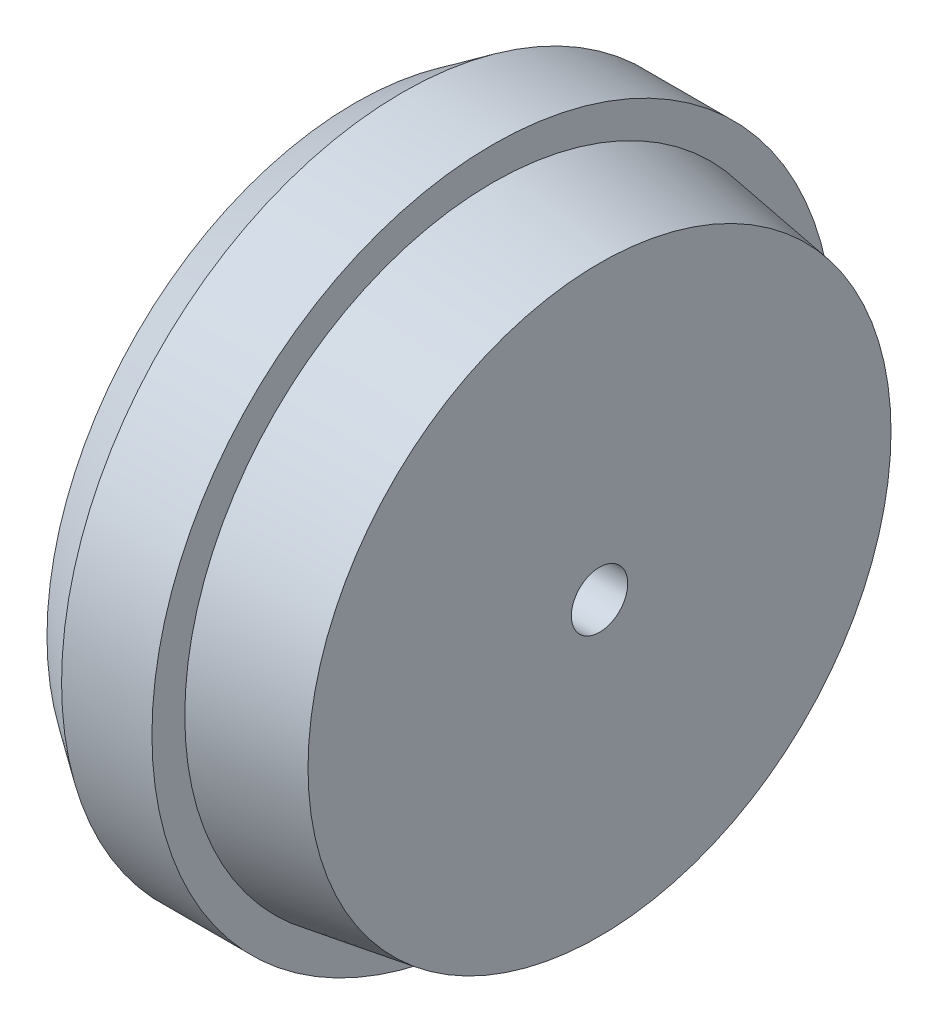
ISO-10303-21;
HEADER;
FILE_DESCRIPTION(('STEP AP214'),'2;1');
FILE_NAME('part.step','',(''),(''),'','','');
FILE_SCHEMA(('AUTOMOTIVE_DESIGN { 1 0 10303 214 1 1 1 1 }'));
ENDSEC;
DATA;
#1=APPLICATION_CONTEXT('core data for automotive mechanical design processes');
#2=APPLICATION_PROTOCOL_DEFINITION('international standard','automotive_design',2000,#1);
#3=PRODUCT_CONTEXT('',#1,'mechanical');
#4=PRODUCT('Part','Part','',(#3));
#5=PRODUCT_RELATED_PRODUCT_CATEGORY('part','',(#4));
#6=PRODUCT_DEFINITION_FORMATION('','',#4);
#7=PRODUCT_DEFINITION_CONTEXT('part definition',#1,'design');
#8=PRODUCT_DEFINITION('design','',#6,#7);
#9=PRODUCT_DEFINITION_SHAPE('','',#8);
#10=(LENGTH_UNIT() NAMED_UNIT(*) SI_UNIT(.MILLI.,.METRE.));
#11=(NAMED_UNIT(*) PLANE_ANGLE_UNIT() SI_UNIT($,.RADIAN.));
#12=(NAMED_UNIT(*) SI_UNIT($,.STERADIAN.) SOLID_ANGLE_UNIT());
#13=UNCERTAINTY_MEASURE_WITH_UNIT(LENGTH_MEASURE(1.E-05),#10,'distance_accuracy_value','');
#14=(GEOMETRIC_REPRESENTATION_CONTEXT(3) GLOBAL_UNCERTAINTY_ASSIGNED_CONTEXT((#13)) GLOBAL_UNIT_ASSIGNED_CONTEXT((#10,
#11,#12)) REPRESENTATION_CONTEXT('',''));
#15=CARTESIAN_POINT('',(0.,0.,0.));
#16=DIRECTION('',(0.,0.,1.));
#17=DIRECTION('',(1.,0.,0.));
#18=AXIS2_PLACEMENT_3D('',#15,#16,#17);
#19=CARTESIAN_POINT('',(540.380162340557,182.950659304077,0.));
#20=DIRECTION('',(1.,0.,0.));
#21=DIRECTION('',(0.,0.,-1.));
#22=AXIS2_PLACEMENT_3D('',#19,#20,#21);
#23=PLANE('',#22);
#24=CARTESIAN_POINT('',(540.380162340557,157.5,0.));
#25=DIRECTION('',(-1.,0.,0.));
#26=DIRECTION('',(0.,0.,1.));
#27=AXIS2_PLACEMENT_3D('',#24,#25,#26);
#28=CIRCLE('',#27,28.4506593040767);
#29=CARTESIAN_POINT('',(540.380162340557,157.5,28.4506593040767));
#30=VERTEX_POINT('',#29);
#31=EDGE_CURVE('E57',#30,#30,#28,.T.);
#32=ORIENTED_EDGE('',*,*,#31,.T.);
#33=EDGE_LOOP('',(#32));
#34=FACE_BOUND('',#33,.T.);
#35=CARTESIAN_POINT('',(540.380162340557,157.5,0.));
#36=DIRECTION('',(-1.,0.,0.));
#37=DIRECTION('',(0.,0.,1.));
#38=AXIS2_PLACEMENT_3D('',#35,#36,#37);
#39=CIRCLE('',#38,22.4506593040767);
#40=CARTESIAN_POINT('',(540.380162340557,157.5,22.4506593040767));
#41=VERTEX_POINT('',#40);
#42=EDGE_CURVE('E18',#41,#41,#39,.F.);
#43=ORIENTED_EDGE('',*,*,#42,.T.);
#44=EDGE_LOOP('',(#43));
#45=FACE_BOUND('',#44,.T.);
#46=ADVANCED_FACE('F15',(#34,#45),#23,.F.);
#47=CARTESIAN_POINT('',(540.380162340557,157.5,0.));
#48=DIRECTION('',(-1.,0.,0.));
#49=DIRECTION('',(0.,0.,1.));
#50=AXIS2_PLACEMENT_3D('',#47,#48,#49);
#51=CONICAL_SURFACE('',#50,22.4506593040767,0.617417972664502);
#52=ORIENTED_EDGE('',*,*,#42,.F.);
#53=EDGE_LOOP('',(#52));
#54=FACE_BOUND('',#53,.T.);
#55=CARTESIAN_POINT('',(543.414213140027,157.5,0.));
#56=DIRECTION('',(1.,0.,0.));
#57=DIRECTION('',(0.,0.,-1.));
#58=AXIS2_PLACEMENT_3D('',#55,#56,#57);
#59=CIRCLE('',#58,20.2964281045427);
#60=CARTESIAN_POINT('',(543.414213140027,157.5,-20.2964281045427));
#61=VERTEX_POINT('',#60);
#62=EDGE_CURVE('E30',#61,#61,#59,.T.);
#63=ORIENTED_EDGE('',*,*,#62,.T.);
#64=EDGE_LOOP('',(#63));
#65=FACE_BOUND('',#64,.T.);
#66=ADVANCED_FACE('F66',(#54,#65),#51,.F.);
#67=CARTESIAN_POINT('',(538.225183996548,157.5,0.));
#68=DIRECTION('',(-1.,0.,0.));
#69=DIRECTION('',(0.,0.,1.));
#70=AXIS2_PLACEMENT_3D('',#67,#68,#69);
#71=CONICAL_SURFACE('',#70,30.6984355865019,0.806472288147619);
#72=CARTESIAN_POINT('',(538.225183996548,157.5,0.));
#73=DIRECTION('',(-1.,0.,0.));
#74=DIRECTION('',(0.,0.,1.));
#75=AXIS2_PLACEMENT_3D('',#72,#73,#74);
#76=CIRCLE('',#75,30.6984355865019);
#77=CARTESIAN_POINT('',(538.225183996548,157.5,30.6984355865019));
#78=VERTEX_POINT('',#77);
#79=EDGE_CURVE('E55',#78,#78,#76,.T.);
#80=ORIENTED_EDGE('',*,*,#79,.T.);
#81=EDGE_LOOP('',(#80));
#82=FACE_BOUND('',#81,.T.);
#83=ORIENTED_EDGE('',*,*,#31,.F.);
#84=EDGE_LOOP('',(#83));
#85=FACE_BOUND('',#84,.T.);
#86=ADVANCED_FACE('F69',(#82,#85),#71,.F.);
#87=CARTESIAN_POINT('',(552.414213140027,157.5,0.));
#88=DIRECTION('',(1.,0.,0.));
#89=DIRECTION('',(0.,0.,-1.));
#90=AXIS2_PLACEMENT_3D('',#87,#88,#89);
#91=CYLINDRICAL_SURFACE('',#90,20.2964281045427);
#92=ORIENTED_EDGE('',*,*,#62,.F.);
#93=EDGE_LOOP('',(#92));
#94=FACE_BOUND('',#93,.T.);
#95=CARTESIAN_POINT('',(561.414213140027,157.5,0.));
#96=DIRECTION('',(1.,0.,0.));
#97=DIRECTION('',(0.,0.,-1.));
#98=AXIS2_PLACEMENT_3D('',#95,#96,#97);
#99=CIRCLE('',#98,20.2964281045427);
#100=CARTESIAN_POINT('',(561.414213140027,157.5,-20.2964281045427));
#101=VERTEX_POINT('',#100);
#102=EDGE_CURVE('E52',#101,#101,#99,.T.);
#103=ORIENTED_EDGE('',*,*,#102,.T.);
#104=EDGE_LOOP('',(#103));
#105=FACE_BOUND('',#104,.T.);
#106=ADVANCED_FACE('F72',(#94,#105),#91,.F.);
#107=CARTESIAN_POINT('',(538.225183996548,191.591028649868,0.));
#108=DIRECTION('',(1.,0.,0.));
#109=DIRECTION('',(0.,0.,-1.));
#110=AXIS2_PLACEMENT_3D('',#107,#108,#109);
#111=PLANE('',#110);
#112=CARTESIAN_POINT('',(538.225183996548,157.5,0.));
#113=DIRECTION('',(1.,0.,0.));
#114=DIRECTION('',(0.,0.,-1.));
#115=AXIS2_PLACEMENT_3D('',#112,#113,#114);
#116=CIRCLE('',#115,37.483621713234);
#117=CARTESIAN_POINT('',(538.225183996548,157.5,-37.483621713234));
#118=VERTEX_POINT('',#117);
#119=EDGE_CURVE('E49',#118,#118,#116,.T.);
#120=ORIENTED_EDGE('',*,*,#119,.F.);
#121=EDGE_LOOP('',(#120));
#122=FACE_BOUND('',#121,.T.);
#123=ORIENTED_EDGE('',*,*,#79,.F.);
#124=EDGE_LOOP('',(#123));
#125=FACE_BOUND('',#124,.T.);
#126=ADVANCED_FACE('F75',(#122,#125),#111,.F.);
#127=CARTESIAN_POINT('',(561.414213140027,173.285973635778,0.));
#128=DIRECTION('',(1.,0.,0.));
#129=DIRECTION('',(0.,0.,-1.));
#130=AXIS2_PLACEMENT_3D('',#127,#128,#129);
#131=PLANE('',#130);
#132=ORIENTED_EDGE('',*,*,#102,.F.);
#133=EDGE_LOOP('',(#132));
#134=FACE_BOUND('',#133,.T.);
#135=CARTESIAN_POINT('',(561.414213140027,157.5,0.));
#136=DIRECTION('',(1.,0.,0.));
#137=DIRECTION('',(0.,0.,-1.));
#138=AXIS2_PLACEMENT_3D('',#135,#136,#137);
#139=CIRCLE('',#138,11.2755191670138);
#140=CARTESIAN_POINT('',(561.414213140027,157.5,-11.2755191670138));
#141=VERTEX_POINT('',#140);
#142=EDGE_CURVE('E45',#141,#141,#139,.F.);
#143=ORIENTED_EDGE('',*,*,#142,.F.);
#144=EDGE_LOOP('',(#143));
#145=FACE_BOUND('',#144,.T.);
#146=ADVANCED_FACE('F79',(#134,#145),#131,.F.);
#147=CARTESIAN_POINT('',(544.,157.5,0.));
#148=DIRECTION('',(1.,0.,0.));
#149=DIRECTION('',(0.,0.,-1.));
#150=AXIS2_PLACEMENT_3D('',#147,#148,#149);
#151=CONICAL_SURFACE('',#150,41.483621713234,0.605784650482831);
#152=ORIENTED_EDGE('',*,*,#119,.T.);
#153=EDGE_LOOP('',(#152));
#154=FACE_BOUND('',#153,.T.);
#155=CARTESIAN_POINT('',(544.,157.5,0.));
#156=DIRECTION('',(1.,0.,0.));
#157=DIRECTION('',(0.,0.,-1.));
#158=AXIS2_PLACEMENT_3D('',#155,#156,#157);
#159=CIRCLE('',#158,41.483621713234);
#160=CARTESIAN_POINT('',(544.,157.5,-41.483621713234));
#161=VERTEX_POINT('',#160);
#162=EDGE_CURVE('E48',#161,#161,#159,.T.);
#163=ORIENTED_EDGE('',*,*,#162,.F.);
#164=EDGE_LOOP('',(#163));
#165=FACE_BOUND('',#164,.T.);
#166=ADVANCED_FACE('F82',(#154,#165),#151,.T.);
#167=CARTESIAN_POINT('',(561.414213140027,157.5,0.));
#168=DIRECTION('',(1.,0.,0.));
#169=DIRECTION('',(0.,0.,-1.));
#170=AXIS2_PLACEMENT_3D('',#167,#168,#169);
#171=CONICAL_SURFACE('',#170,11.2755191670138,0.160961921223568);
#172=ORIENTED_EDGE('',*,*,#142,.T.);
#173=EDGE_LOOP('',(#172));
#174=FACE_BOUND('',#173,.T.);
#175=CARTESIAN_POINT('',(549.225183996548,157.5,0.));
#176=DIRECTION('',(-1.,0.,0.));
#177=DIRECTION('',(0.,0.,1.));
#178=AXIS2_PLACEMENT_3D('',#175,#176,#177);
#179=CIRCLE('',#178,9.29642810454271);
#180=CARTESIAN_POINT('',(549.225183996548,157.5,9.29642810454271));
#181=VERTEX_POINT('',#180);
#182=EDGE_CURVE('E44',#181,#181,#179,.T.);
#183=ORIENTED_EDGE('',*,*,#182,.F.);
#184=EDGE_LOOP('',(#183));
#185=FACE_BOUND('',#184,.T.);
#186=ADVANCED_FACE('F86',(#174,#185),#171,.T.);
#187=CARTESIAN_POINT('',(549.5,157.5,0.));
#188=DIRECTION('',(1.,0.,0.));
#189=DIRECTION('',(0.,0.,-1.));
#190=AXIS2_PLACEMENT_3D('',#187,#188,#189);
#191=CYLINDRICAL_SURFACE('',#190,41.483621713234);
#192=CARTESIAN_POINT('',(555.,157.5,0.));
#193=DIRECTION('',(1.,0.,0.));
#194=DIRECTION('',(0.,0.,-1.));
#195=AXIS2_PLACEMENT_3D('',#192,#193,#194);
#196=CIRCLE('',#195,41.483621713234);
#197=CARTESIAN_POINT('',(555.,157.5,-41.483621713234));
#198=VERTEX_POINT('',#197);
#199=EDGE_CURVE('E41',#198,#198,#196,.T.);
#200=ORIENTED_EDGE('',*,*,#199,.F.);
#201=EDGE_LOOP('',(#200));
#202=FACE_BOUND('',#201,.T.);
#203=ORIENTED_EDGE('',*,*,#162,.T.);
#204=EDGE_LOOP('',(#203));
#205=FACE_BOUND('',#204,.T.);
#206=ADVANCED_FACE('F89',(#202,#205),#191,.T.);
#207=CARTESIAN_POINT('',(543.725183996548,157.5,0.));
#208=DIRECTION('',(-1.,0.,0.));
#209=DIRECTION('',(0.,0.,1.));
#210=AXIS2_PLACEMENT_3D('',#207,#208,#209);
#211=CYLINDRICAL_SURFACE('',#210,9.29642810454271);
#212=ORIENTED_EDGE('',*,*,#182,.T.);
#213=EDGE_LOOP('',(#212));
#214=FACE_BOUND('',#213,.T.);
#215=CARTESIAN_POINT('',(538.225183996548,157.5,0.));
#216=DIRECTION('',(-1.,0.,0.));
#217=DIRECTION('',(0.,0.,1.));
#218=AXIS2_PLACEMENT_3D('',#215,#216,#217);
#219=CIRCLE('',#218,9.29642810454271);
#220=CARTESIAN_POINT('',(538.225183996548,157.5,9.29642810454271));
#221=VERTEX_POINT('',#220);
#222=EDGE_CURVE('E38',#221,#221,#219,.F.);
#223=ORIENTED_EDGE('',*,*,#222,.T.);
#224=EDGE_LOOP('',(#223));
#225=FACE_BOUND('',#224,.T.);
#226=ADVANCED_FACE('F128',(#214,#225),#211,.T.);
#227=CARTESIAN_POINT('',(555.,196.983621713234,0.));
#228=DIRECTION('',(1.,0.,0.));
#229=DIRECTION('',(0.,0.,-1.));
#230=AXIS2_PLACEMENT_3D('',#227,#228,#229);
#231=PLANE('',#230);
#232=CARTESIAN_POINT('',(555.,157.5,0.));
#233=DIRECTION('',(-1.,0.,0.));
#234=DIRECTION('',(0.,0.,1.));
#235=AXIS2_PLACEMENT_3D('',#232,#233,#234);
#236=CIRCLE('',#235,37.483621713234);
#237=CARTESIAN_POINT('',(555.,157.5,37.483621713234));
#238=VERTEX_POINT('',#237);
#239=EDGE_CURVE('E35',#238,#238,#236,.F.);
#240=ORIENTED_EDGE('',*,*,#239,.F.);
#241=EDGE_LOOP('',(#240));
#242=FACE_BOUND('',#241,.T.);
#243=ORIENTED_EDGE('',*,*,#199,.T.);
#244=EDGE_LOOP('',(#243));
#245=FACE_BOUND('',#244,.T.);
#246=ADVANCED_FACE('F124',(#242,#245),#231,.T.);
#247=CARTESIAN_POINT('',(538.225183996548,163.864328209554,0.));
#248=DIRECTION('',(1.,0.,0.));
#249=DIRECTION('',(0.,0.,-1.));
#250=AXIS2_PLACEMENT_3D('',#247,#248,#249);
#251=PLANE('',#250);
#252=ORIENTED_EDGE('',*,*,#222,.F.);
#253=EDGE_LOOP('',(#252));
#254=FACE_BOUND('',#253,.T.);
#255=CARTESIAN_POINT('',(538.225183996548,157.5,0.));
#256=DIRECTION('',(-1.,0.,0.));
#257=DIRECTION('',(0.,0.,1.));
#258=AXIS2_PLACEMENT_3D('',#255,#256,#257);
#259=CIRCLE('',#258,3.43222831456501);
#260=CARTESIAN_POINT('',(538.225183996548,157.5,3.43222831456501));
#261=VERTEX_POINT('',#260);
#262=EDGE_CURVE('E27',#261,#261,#259,.F.);
#263=ORIENTED_EDGE('',*,*,#262,.T.);
#264=EDGE_LOOP('',(#263));
#265=FACE_BOUND('',#264,.T.);
#266=ADVANCED_FACE('F120',(#254,#265),#251,.F.);
#267=CARTESIAN_POINT('',(555.,157.5,0.));
#268=DIRECTION('',(-1.,0.,0.));
#269=DIRECTION('',(0.,0.,1.));
#270=AXIS2_PLACEMENT_3D('',#267,#268,#269);
#271=CONICAL_SURFACE('',#270,37.483621713234,0.152649328395265);
#272=CARTESIAN_POINT('',(568.,157.5,0.));
#273=DIRECTION('',(-1.,0.,0.));
#274=DIRECTION('',(0.,0.,1.));
#275=AXIS2_PLACEMENT_3D('',#272,#273,#274);
#276=CIRCLE('',#275,35.483621713234);
#277=CARTESIAN_POINT('',(568.,157.5,35.483621713234));
#278=VERTEX_POINT('',#277);
#279=EDGE_CURVE('E22',#278,#278,#276,.T.);
#280=ORIENTED_EDGE('',*,*,#279,.T.);
#281=EDGE_LOOP('',(#280));
#282=FACE_BOUND('',#281,.T.);
#283=ORIENTED_EDGE('',*,*,#239,.T.);
#284=EDGE_LOOP('',(#283));
#285=FACE_BOUND('',#284,.T.);
#286=ADVANCED_FACE('F113',(#282,#285),#271,.T.);
#287=CARTESIAN_POINT('',(553.112591998274,157.5,0.));
#288=DIRECTION('',(-1.,0.,0.));
#289=DIRECTION('',(0.,0.,1.));
#290=AXIS2_PLACEMENT_3D('',#287,#288,#289);
#291=CYLINDRICAL_SURFACE('',#290,3.43222831456501);
#292=ORIENTED_EDGE('',*,*,#262,.F.);
#293=EDGE_LOOP('',(#292));
#294=FACE_BOUND('',#293,.T.);
#295=CARTESIAN_POINT('',(568.,157.5,0.));
#296=DIRECTION('',(-1.,0.,0.));
#297=DIRECTION('',(0.,0.,1.));
#298=AXIS2_PLACEMENT_3D('',#295,#296,#297);
#299=CIRCLE('',#298,3.43222831456501);
#300=CARTESIAN_POINT('',(568.,157.5,3.43222831456501));
#301=VERTEX_POINT('',#300);
#302=EDGE_CURVE('E10',#301,#301,#299,.F.);
#303=ORIENTED_EDGE('',*,*,#302,.T.);
#304=EDGE_LOOP('',(#303));
#305=FACE_BOUND('',#304,.T.);
#306=ADVANCED_FACE('F107',(#294,#305),#291,.F.);
#307=CARTESIAN_POINT('',(568.,176.9579250139,0.));
#308=DIRECTION('',(-1.,0.,0.));
#309=DIRECTION('',(0.,0.,1.));
#310=AXIS2_PLACEMENT_3D('',#307,#308,#309);
#311=PLANE('',#310);
#312=ORIENTED_EDGE('',*,*,#302,.F.);
#313=EDGE_LOOP('',(#312));
#314=FACE_BOUND('',#313,.T.);
#315=ORIENTED_EDGE('',*,*,#279,.F.);
#316=EDGE_LOOP('',(#315));
#317=FACE_BOUND('',#316,.T.);
#318=ADVANCED_FACE('F105',(#314,#317),#311,.F.);
#319=CLOSED_SHELL('',(#46,#66,#86,#106,#126,#146,#166,#186,#206,#226,#246,#266,#286,#306,#318));
#320=MANIFOLD_SOLID_BREP('B1',#319);
#321=ADVANCED_BREP_SHAPE_REPRESENTATION('',(#18,#320),#14);
#322=SHAPE_DEFINITION_REPRESENTATION(#9,#321);
ENDSEC;
END-ISO-10303-21;
